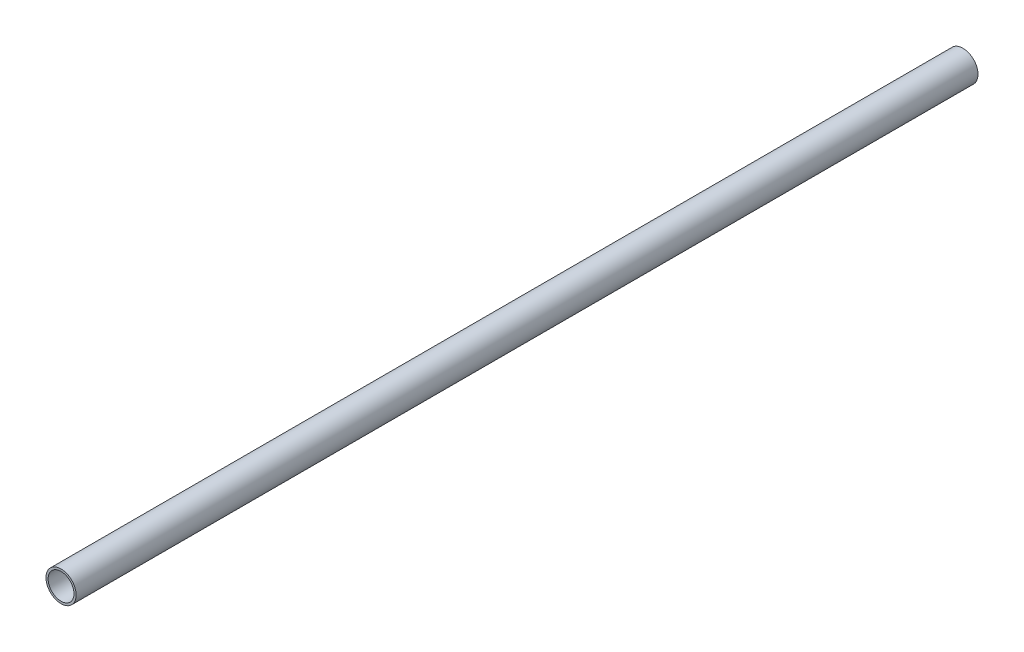
ISO-10303-21;
HEADER;
FILE_DESCRIPTION(('STEP AP214'),'2;1');
FILE_NAME('part.step','',(''),(''),'','','');
FILE_SCHEMA(('AUTOMOTIVE_DESIGN { 1 0 10303 214 1 1 1 1 }'));
ENDSEC;
DATA;
#1=APPLICATION_CONTEXT('core data for automotive mechanical design processes');
#2=APPLICATION_PROTOCOL_DEFINITION('international standard','automotive_design',2000,#1);
#3=PRODUCT_CONTEXT('',#1,'mechanical');
#4=PRODUCT('Part','Part','',(#3));
#5=PRODUCT_RELATED_PRODUCT_CATEGORY('part','',(#4));
#6=PRODUCT_DEFINITION_FORMATION('','',#4);
#7=PRODUCT_DEFINITION_CONTEXT('part definition',#1,'design');
#8=PRODUCT_DEFINITION('design','',#6,#7);
#9=PRODUCT_DEFINITION_SHAPE('','',#8);
#10=(LENGTH_UNIT() NAMED_UNIT(*) SI_UNIT(.MILLI.,.METRE.));
#11=(NAMED_UNIT(*) PLANE_ANGLE_UNIT() SI_UNIT($,.RADIAN.));
#12=(NAMED_UNIT(*) SI_UNIT($,.STERADIAN.) SOLID_ANGLE_UNIT());
#13=UNCERTAINTY_MEASURE_WITH_UNIT(LENGTH_MEASURE(1.E-05),#10,'distance_accuracy_value','');
#14=(GEOMETRIC_REPRESENTATION_CONTEXT(3) GLOBAL_UNCERTAINTY_ASSIGNED_CONTEXT((#13)) GLOBAL_UNIT_ASSIGNED_CONTEXT((#10,
#11,#12)) REPRESENTATION_CONTEXT('',''));
#15=CARTESIAN_POINT('',(0.,0.,0.));
#16=DIRECTION('',(0.,0.,1.));
#17=DIRECTION('',(1.,0.,0.));
#18=AXIS2_PLACEMENT_3D('',#15,#16,#17);
#19=CARTESIAN_POINT('',(0.,0.,332.359));
#20=DIRECTION('',(0.,0.,1.));
#21=DIRECTION('',(1.,0.,0.));
#22=AXIS2_PLACEMENT_3D('',#19,#20,#21);
#23=PLANE('',#22);
#24=CARTESIAN_POINT('',(0.,0.,332.359));
#25=DIRECTION('',(0.,0.,1.));
#26=DIRECTION('',(1.,0.,0.));
#27=AXIS2_PLACEMENT_3D('',#24,#25,#26);
#28=CIRCLE('',#27,11.1125);
#29=CARTESIAN_POINT('',(11.1125,0.,332.359));
#30=VERTEX_POINT('',#29);
#31=EDGE_CURVE('E10',#30,#30,#28,.T.);
#32=ORIENTED_EDGE('',*,*,#31,.T.);
#33=EDGE_LOOP('',(#32));
#34=FACE_BOUND('',#33,.T.);
#35=CARTESIAN_POINT('',(0.,0.,332.359));
#36=DIRECTION('',(0.,0.,1.));
#37=DIRECTION('',(1.,0.,0.));
#38=AXIS2_PLACEMENT_3D('',#35,#36,#37);
#39=CIRCLE('',#38,9.525);
#40=CARTESIAN_POINT('',(9.525,0.,332.359));
#41=VERTEX_POINT('',#40);
#42=EDGE_CURVE('E50',#41,#41,#39,.T.);
#43=ORIENTED_EDGE('',*,*,#42,.F.);
#44=EDGE_LOOP('',(#43));
#45=FACE_BOUND('',#44,.T.);
#46=ADVANCED_FACE('F39',(#34,#45),#23,.T.);
#47=CARTESIAN_POINT('',(0.,0.,-332.359));
#48=DIRECTION('',(0.,0.,1.));
#49=DIRECTION('',(1.,0.,0.));
#50=AXIS2_PLACEMENT_3D('',#47,#48,#49);
#51=PLANE('',#50);
#52=CARTESIAN_POINT('',(0.,0.,-332.359));
#53=DIRECTION('',(0.,0.,1.));
#54=DIRECTION('',(1.,0.,0.));
#55=AXIS2_PLACEMENT_3D('',#52,#53,#54);
#56=CIRCLE('',#55,11.1125);
#57=CARTESIAN_POINT('',(11.1125,0.,-332.359));
#58=VERTEX_POINT('',#57);
#59=EDGE_CURVE('E43',#58,#58,#56,.T.);
#60=ORIENTED_EDGE('',*,*,#59,.F.);
#61=EDGE_LOOP('',(#60));
#62=FACE_BOUND('',#61,.T.);
#63=CARTESIAN_POINT('',(0.,0.,-332.359));
#64=DIRECTION('',(0.,0.,1.));
#65=DIRECTION('',(1.,0.,0.));
#66=AXIS2_PLACEMENT_3D('',#63,#64,#65);
#67=CIRCLE('',#66,9.525);
#68=CARTESIAN_POINT('',(9.525,0.,-332.359));
#69=VERTEX_POINT('',#68);
#70=EDGE_CURVE('E52',#69,#69,#67,.T.);
#71=ORIENTED_EDGE('',*,*,#70,.T.);
#72=EDGE_LOOP('',(#71));
#73=FACE_BOUND('',#72,.T.);
#74=ADVANCED_FACE('F62',(#62,#73),#51,.F.);
#75=CARTESIAN_POINT('',(0.,0.,332.359));
#76=DIRECTION('',(0.,0.,-1.));
#77=DIRECTION('',(-1.,0.,0.));
#78=AXIS2_PLACEMENT_3D('',#75,#76,#77);
#79=CYLINDRICAL_SURFACE('',#78,11.1125);
#80=ORIENTED_EDGE('',*,*,#31,.F.);
#81=EDGE_LOOP('',(#80));
#82=FACE_BOUND('',#81,.T.);
#83=ORIENTED_EDGE('',*,*,#59,.T.);
#84=EDGE_LOOP('',(#83));
#85=FACE_BOUND('',#84,.T.);
#86=ADVANCED_FACE('F41',(#82,#85),#79,.T.);
#87=CARTESIAN_POINT('',(0.,0.,332.359));
#88=DIRECTION('',(0.,0.,-1.));
#89=DIRECTION('',(-1.,0.,0.));
#90=AXIS2_PLACEMENT_3D('',#87,#88,#89);
#91=CYLINDRICAL_SURFACE('',#90,9.525);
#92=ORIENTED_EDGE('',*,*,#42,.T.);
#93=EDGE_LOOP('',(#92));
#94=FACE_BOUND('',#93,.T.);
#95=ORIENTED_EDGE('',*,*,#70,.F.);
#96=EDGE_LOOP('',(#95));
#97=FACE_BOUND('',#96,.T.);
#98=ADVANCED_FACE('F58',(#94,#97),#91,.F.);
#99=CLOSED_SHELL('',(#46,#74,#86,#98));
#100=MANIFOLD_SOLID_BREP('B2',#99);
#101=ADVANCED_BREP_SHAPE_REPRESENTATION('',(#18,#100),#14);
#102=SHAPE_DEFINITION_REPRESENTATION(#9,#101);
ENDSEC;
END-ISO-10303-21;
